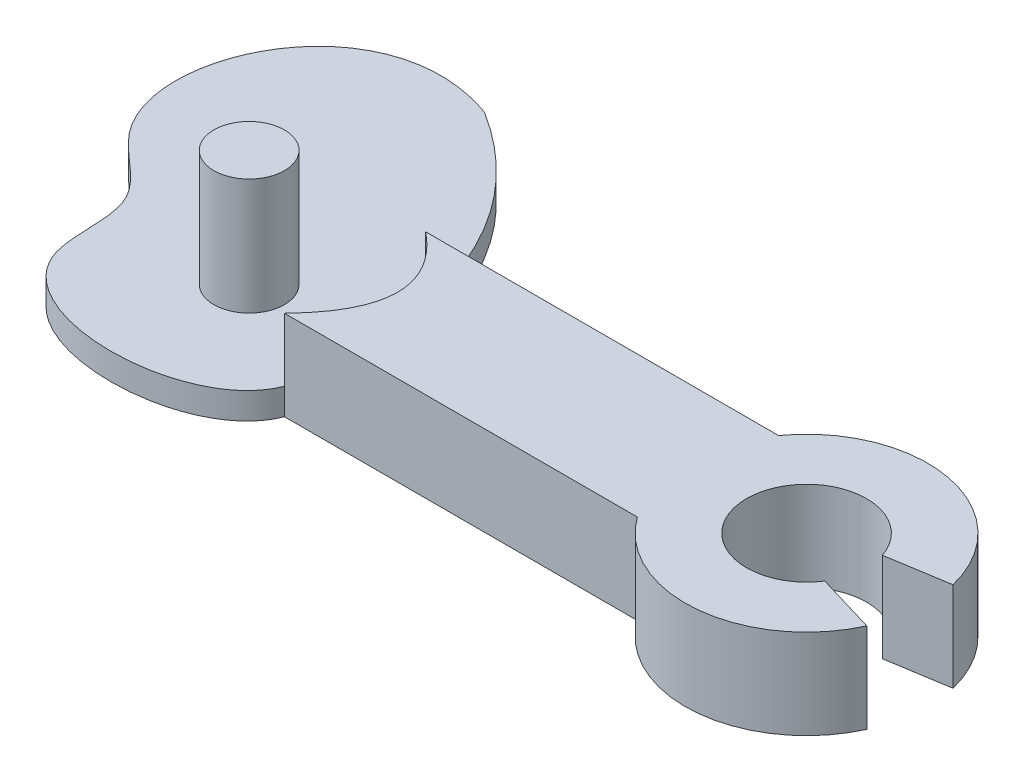
ISO-10303-21;
HEADER;
FILE_DESCRIPTION(('STEP AP214'),'2;1');
FILE_NAME('part.step','',(''),(''),'','','');
FILE_SCHEMA(('AUTOMOTIVE_DESIGN { 1 0 10303 214 1 1 1 1 }'));
ENDSEC;
DATA;
#1=APPLICATION_CONTEXT('core data for automotive mechanical design processes');
#2=APPLICATION_PROTOCOL_DEFINITION('international standard','automotive_design',2000,#1);
#3=PRODUCT_CONTEXT('',#1,'mechanical');
#4=PRODUCT('Part','Part','',(#3));
#5=PRODUCT_RELATED_PRODUCT_CATEGORY('part','',(#4));
#6=PRODUCT_DEFINITION_FORMATION('','',#4);
#7=PRODUCT_DEFINITION_CONTEXT('part definition',#1,'design');
#8=PRODUCT_DEFINITION('design','',#6,#7);
#9=PRODUCT_DEFINITION_SHAPE('','',#8);
#10=(LENGTH_UNIT() NAMED_UNIT(*) SI_UNIT(.MILLI.,.METRE.));
#11=(NAMED_UNIT(*) PLANE_ANGLE_UNIT() SI_UNIT($,.RADIAN.));
#12=(NAMED_UNIT(*) SI_UNIT($,.STERADIAN.) SOLID_ANGLE_UNIT());
#13=UNCERTAINTY_MEASURE_WITH_UNIT(LENGTH_MEASURE(1.E-05),#10,'distance_accuracy_value','');
#14=(GEOMETRIC_REPRESENTATION_CONTEXT(3) GLOBAL_UNCERTAINTY_ASSIGNED_CONTEXT((#13)) GLOBAL_UNIT_ASSIGNED_CONTEXT((#10,
#11,#12)) REPRESENTATION_CONTEXT('',''));
#15=CARTESIAN_POINT('',(0.,0.,0.));
#16=DIRECTION('',(0.,0.,1.));
#17=DIRECTION('',(1.,0.,0.));
#18=AXIS2_PLACEMENT_3D('',#15,#16,#17);
#19=CARTESIAN_POINT('',(-3.89207128643076,2.54,-7.55845384981425));
#20=CARTESIAN_POINT('',(-0.771451313437752,2.54,-5.60167972688043));
#21=CARTESIAN_POINT('',(0.,2.54,-2.));
#22=B_SPLINE_CURVE_WITH_KNOTS('',2,(#19,#20,#21),.UNSPECIFIED.,.F.,.F.,(3,3),(0.,1.),.UNSPECIFIED.);
#23=DIRECTION('',(0.,-1.,0.));
#24=VECTOR('',#23,1.);
#25=SURFACE_OF_LINEAR_EXTRUSION('',#22,#24);
#26=DIRECTION('',(0.,-1.,0.));
#27=VECTOR('',#26,1.);
#28=CARTESIAN_POINT('',(-3.89207128643076,2.54,-7.55845384981425));
#29=LINE('',#28,#27);
#30=CARTESIAN_POINT('',(-3.89207128643076,0.75,-7.55845384981425));
#31=VERTEX_POINT('',#30);
#32=CARTESIAN_POINT('',(-3.89207128643076,0.,-7.55845384981425));
#33=VERTEX_POINT('',#32);
#34=EDGE_CURVE('E184',#31,#33,#29,.T.);
#35=ORIENTED_EDGE('',*,*,#34,.F.);
#36=CARTESIAN_POINT('',(-3.89207128643076,0.75,-7.55845384981425));
#37=CARTESIAN_POINT('',(-0.771451313437752,0.75,-5.60167972688043));
#38=CARTESIAN_POINT('',(0.,0.75,-2.));
#39=B_SPLINE_CURVE_WITH_KNOTS('',2,(#36,#37,#38),.UNSPECIFIED.,.F.,.F.,(3,3),(0.,1.),.UNSPECIFIED.);
#40=CARTESIAN_POINT('',(0.,0.75,-2.));
#41=VERTEX_POINT('',#40);
#42=EDGE_CURVE('E248',#31,#41,#39,.T.);
#43=ORIENTED_EDGE('',*,*,#42,.T.);
#44=DIRECTION('',(0.,-1.,0.));
#45=VECTOR('',#44,1.);
#46=CARTESIAN_POINT('',(0.,2.54,-2.));
#47=LINE('',#46,#45);
#48=CARTESIAN_POINT('',(0.,0.,-2.));
#49=VERTEX_POINT('',#48);
#50=EDGE_CURVE('E186',#41,#49,#47,.T.);
#51=ORIENTED_EDGE('',*,*,#50,.T.);
#52=CARTESIAN_POINT('',(-3.89207128643076,0.,-7.55845384981425));
#53=CARTESIAN_POINT('',(-0.771451313437752,0.,-5.60167972688043));
#54=CARTESIAN_POINT('',(0.,0.,-2.));
#55=B_SPLINE_CURVE_WITH_KNOTS('',2,(#52,#53,#54),.UNSPECIFIED.,.F.,.F.,(3,3),(0.,1.),.UNSPECIFIED.);
#56=EDGE_CURVE('E161',#33,#49,#55,.T.);
#57=ORIENTED_EDGE('',*,*,#56,.F.);
#58=EDGE_LOOP('',(#35,#43,#51,#57));
#59=FACE_BOUND('',#58,.T.);
#60=ADVANCED_FACE('F40',(#59),#25,.T.);
#61=CARTESIAN_POINT('',(0.,2.54,2.));
#62=CARTESIAN_POINT('',(-0.807019420727667,2.54,4.09860570024204));
#63=CARTESIAN_POINT('',(-7.36080053652823,2.54,4.19627669887293));
#64=CARTESIAN_POINT('',(-6.34345772525978,2.54,-0.548340216859602));
#65=CARTESIAN_POINT('',(-10.7782323983558,2.54,-2.92902577270383));
#66=CARTESIAN_POINT('',(-8.05166562519426,2.54,-9.04548340443192));
#67=CARTESIAN_POINT('',(-3.89207128643076,2.54,-7.55845384981425));
#68=B_SPLINE_CURVE_WITH_KNOTS('',3,(#61,#62,#63,#64,#65,#66,#67),.UNSPECIFIED.,.F.,.F.,(4,1,1,1,
4),(0.,0.355860312878933,0.470047608142096,0.583542680614252,1.),.UNSPECIFIED.);
#69=DIRECTION('',(0.,-1.,0.));
#70=VECTOR('',#69,1.);
#71=SURFACE_OF_LINEAR_EXTRUSION('',#68,#70);
#72=DIRECTION('',(0.,-1.,0.));
#73=VECTOR('',#72,1.);
#74=CARTESIAN_POINT('',(0.,2.54,2.));
#75=LINE('',#74,#73);
#76=CARTESIAN_POINT('',(0.,0.75,2.));
#77=VERTEX_POINT('',#76);
#78=CARTESIAN_POINT('',(0.,0.,2.));
#79=VERTEX_POINT('',#78);
#80=EDGE_CURVE('E127',#77,#79,#75,.T.);
#81=ORIENTED_EDGE('',*,*,#80,.F.);
#82=CARTESIAN_POINT('',(0.,0.75,2.));
#83=CARTESIAN_POINT('',(-0.807019420727667,0.75,4.09860570024204));
#84=CARTESIAN_POINT('',(-7.36080053652823,0.75,4.19627669887293));
#85=CARTESIAN_POINT('',(-6.34345772525978,0.75,-0.548340216859602));
#86=CARTESIAN_POINT('',(-10.7782323983558,0.75,-2.92902577270383));
#87=CARTESIAN_POINT('',(-8.05166562519426,0.75,-9.04548340443192));
#88=CARTESIAN_POINT('',(-3.89207128643076,0.75,-7.55845384981425));
#89=B_SPLINE_CURVE_WITH_KNOTS('',3,(#82,#83,#84,#85,#86,#87,#88),.UNSPECIFIED.,.F.,.F.,(4,1,1,1,
4),(0.,0.355860312878933,0.470047608142096,0.583542680614252,1.),.UNSPECIFIED.);
#90=EDGE_CURVE('E253',#77,#31,#89,.T.);
#91=ORIENTED_EDGE('',*,*,#90,.T.);
#92=ORIENTED_EDGE('',*,*,#34,.T.);
#93=CARTESIAN_POINT('',(0.,0.,2.));
#94=CARTESIAN_POINT('',(-0.807019420727667,0.,4.09860570024204));
#95=CARTESIAN_POINT('',(-7.36080053652823,0.,4.19627669887293));
#96=CARTESIAN_POINT('',(-6.34345772525978,0.,-0.548340216859602));
#97=CARTESIAN_POINT('',(-10.7782323983558,0.,-2.92902577270383));
#98=CARTESIAN_POINT('',(-8.05166562519426,0.,-9.04548340443192));
#99=CARTESIAN_POINT('',(-3.89207128643076,0.,-7.55845384981425));
#100=B_SPLINE_CURVE_WITH_KNOTS('',3,(#93,#94,#95,#96,#97,#98,#99),.UNSPECIFIED.,.F.,.F.,(4,1,1,
1,4),(0.,0.355860312878933,0.470047608142096,0.583542680614252,1.),.UNSPECIFIED.);
#101=EDGE_CURVE('E166',#79,#33,#100,.T.);
#102=ORIENTED_EDGE('',*,*,#101,.F.);
#103=EDGE_LOOP('',(#81,#91,#92,#102));
#104=FACE_BOUND('',#103,.T.);
#105=ADVANCED_FACE('F218',(#104),#71,.T.);
#106=CARTESIAN_POINT('',(12.794,2.54,0.));
#107=DIRECTION('',(0.,-1.,0.));
#108=DIRECTION('',(0.,0.,-1.));
#109=AXIS2_PLACEMENT_3D('',#106,#107,#108);
#110=CYLINDRICAL_SURFACE('',#109,1.7);
#111=CARTESIAN_POINT('',(12.794,0.,0.));
#112=DIRECTION('',(0.,1.,0.));
#113=DIRECTION('',(0.,0.,1.));
#114=AXIS2_PLACEMENT_3D('',#111,#112,#113);
#115=CIRCLE('',#114,1.7);
#116=CARTESIAN_POINT('',(14.2261023097936,0.,0.916014723835713));
#117=VERTEX_POINT('',#116);
#118=CARTESIAN_POINT('',(14.408639420947,0.,-0.531920614682185));
#119=VERTEX_POINT('',#118);
#120=EDGE_CURVE('E148',#117,#119,#115,.F.);
#121=ORIENTED_EDGE('',*,*,#120,.T.);
#122=DIRECTION('',(0.,-1.,0.));
#123=VECTOR('',#122,1.);
#124=CARTESIAN_POINT('',(14.408639420947,2.54,-0.531920614682185));
#125=LINE('',#124,#123);
#126=CARTESIAN_POINT('',(14.408639420947,2.54,-0.531920614682185));
#127=VERTEX_POINT('',#126);
#128=EDGE_CURVE('E194',#127,#119,#125,.T.);
#129=ORIENTED_EDGE('',*,*,#128,.F.);
#130=CARTESIAN_POINT('',(12.794,2.54,0.));
#131=DIRECTION('',(0.,1.,0.));
#132=DIRECTION('',(0.,0.,1.));
#133=AXIS2_PLACEMENT_3D('',#130,#131,#132);
#134=CIRCLE('',#133,1.7);
#135=CARTESIAN_POINT('',(14.2261023097936,2.54,0.916014723835713));
#136=VERTEX_POINT('',#135);
#137=EDGE_CURVE('E103',#136,#127,#134,.F.);
#138=ORIENTED_EDGE('',*,*,#137,.F.);
#139=DIRECTION('',(0.,-1.,0.));
#140=VECTOR('',#139,1.);
#141=CARTESIAN_POINT('',(14.2261023097936,2.54,0.916014723835713));
#142=LINE('',#141,#140);
#143=EDGE_CURVE('E147',#136,#117,#142,.T.);
#144=ORIENTED_EDGE('',*,*,#143,.T.);
#145=EDGE_LOOP('',(#121,#129,#138,#144));
#146=FACE_BOUND('',#145,.T.);
#147=ADVANCED_FACE('F42',(#146),#110,.F.);
#148=CARTESIAN_POINT('',(0.281759382160779,2.54,1.74677809510191));
#149=DIRECTION('',(0.159243995436628,0.,0.987239256673568));
#150=DIRECTION('',(0.987239256673568,0.,-0.159243995436628));
#151=AXIS2_PLACEMENT_3D('',#148,#149,#150);
#152=PLANE('',#151);
#153=DIRECTION('',(-0.987239256673568,0.,0.159243995436628));
#154=VECTOR('',#153,1.);
#155=CARTESIAN_POINT('',(0.281759382160779,0.,1.74677809510191));
#156=LINE('',#155,#154);
#157=CARTESIAN_POINT('',(16.1331889635571,0.,-0.810094479464426));
#158=VERTEX_POINT('',#157);
#159=EDGE_CURVE('E151',#158,#119,#156,.T.);
#160=ORIENTED_EDGE('',*,*,#159,.F.);
#161=DIRECTION('',(0.,-1.,0.));
#162=VECTOR('',#161,1.);
#163=CARTESIAN_POINT('',(16.1331889635571,2.54,-0.810094479464426));
#164=LINE('',#163,#162);
#165=CARTESIAN_POINT('',(16.1331889635571,2.54,-0.810094479464426));
#166=VERTEX_POINT('',#165);
#167=EDGE_CURVE('E192',#166,#158,#164,.T.);
#168=ORIENTED_EDGE('',*,*,#167,.F.);
#169=DIRECTION('',(-0.987239256673568,0.,0.159243995436628));
#170=VECTOR('',#169,1.);
#171=CARTESIAN_POINT('',(0.281759382160779,2.54,1.74677809510191));
#172=LINE('',#171,#170);
#173=EDGE_CURVE('E240',#166,#127,#172,.T.);
#174=ORIENTED_EDGE('',*,*,#173,.T.);
#175=ORIENTED_EDGE('',*,*,#128,.T.);
#176=EDGE_LOOP('',(#160,#168,#174,#175));
#177=FACE_BOUND('',#176,.T.);
#178=ADVANCED_FACE('F323',(#177),#152,.T.);
#179=CARTESIAN_POINT('',(12.794,2.54,0.));
#180=DIRECTION('',(0.,-1.,0.));
#181=DIRECTION('',(0.,0.,-1.));
#182=AXIS2_PLACEMENT_3D('',#179,#180,#181);
#183=CYLINDRICAL_SURFACE('',#182,3.43604947577883);
#184=CARTESIAN_POINT('',(12.794,0.,0.));
#185=DIRECTION('',(0.,1.,0.));
#186=DIRECTION('',(0.,0.,1.));
#187=AXIS2_PLACEMENT_3D('',#184,#185,#186);
#188=CIRCLE('',#187,3.43604947577883);
#189=CARTESIAN_POINT('',(10.,0.,-2.));
#190=VERTEX_POINT('',#189);
#191=EDGE_CURVE('E155',#190,#158,#188,.F.);
#192=ORIENTED_EDGE('',*,*,#191,.F.);
#193=DIRECTION('',(0.,-1.,0.));
#194=VECTOR('',#193,1.);
#195=CARTESIAN_POINT('',(10.,2.54,-2.));
#196=LINE('',#195,#194);
#197=CARTESIAN_POINT('',(10.,2.54,-2.));
#198=VERTEX_POINT('',#197);
#199=EDGE_CURVE('E190',#198,#190,#196,.T.);
#200=ORIENTED_EDGE('',*,*,#199,.F.);
#201=CARTESIAN_POINT('',(12.794,2.54,0.));
#202=DIRECTION('',(0.,1.,0.));
#203=DIRECTION('',(0.,0.,1.));
#204=AXIS2_PLACEMENT_3D('',#201,#202,#203);
#205=CIRCLE('',#204,3.43604947577883);
#206=EDGE_CURVE('E138',#198,#166,#205,.F.);
#207=ORIENTED_EDGE('',*,*,#206,.T.);
#208=ORIENTED_EDGE('',*,*,#167,.T.);
#209=EDGE_LOOP('',(#192,#200,#207,#208));
#210=FACE_BOUND('',#209,.T.);
#211=ADVANCED_FACE('F321',(#210),#183,.T.);
#212=CARTESIAN_POINT('',(0.,2.54,-2.));
#213=DIRECTION('',(0.,0.,1.));
#214=DIRECTION('',(1.,0.,0.));
#215=AXIS2_PLACEMENT_3D('',#212,#213,#214);
#216=PLANE('',#215);
#217=DIRECTION('',(-1.,0.,0.));
#218=VECTOR('',#217,1.);
#219=CARTESIAN_POINT('',(0.,0.,-2.));
#220=LINE('',#219,#218);
#221=EDGE_CURVE('E158',#190,#49,#220,.T.);
#222=ORIENTED_EDGE('',*,*,#221,.T.);
#223=ORIENTED_EDGE('',*,*,#50,.F.);
#224=CARTESIAN_POINT('',(0.,2.54,-2.));
#225=VERTEX_POINT('',#224);
#226=EDGE_CURVE('E187',#225,#41,#47,.T.);
#227=ORIENTED_EDGE('',*,*,#226,.F.);
#228=DIRECTION('',(-1.,0.,0.));
#229=VECTOR('',#228,1.);
#230=CARTESIAN_POINT('',(0.,2.54,-2.));
#231=LINE('',#230,#229);
#232=EDGE_CURVE('E136',#198,#225,#231,.T.);
#233=ORIENTED_EDGE('',*,*,#232,.F.);
#234=ORIENTED_EDGE('',*,*,#199,.T.);
#235=EDGE_LOOP('',(#222,#223,#227,#233,#234));
#236=FACE_BOUND('',#235,.T.);
#237=ADVANCED_FACE('F229',(#236),#216,.F.);
#238=CARTESIAN_POINT('',(0.,2.54,2.));
#239=DIRECTION('',(0.,0.,1.));
#240=DIRECTION('',(1.,0.,0.));
#241=AXIS2_PLACEMENT_3D('',#238,#239,#240);
#242=PLANE('',#241);
#243=DIRECTION('',(-1.,0.,0.));
#244=VECTOR('',#243,1.);
#245=CARTESIAN_POINT('',(0.,0.,2.));
#246=LINE('',#245,#244);
#247=CARTESIAN_POINT('',(10.,0.,2.));
#248=VERTEX_POINT('',#247);
#249=EDGE_CURVE('E126',#248,#79,#246,.T.);
#250=ORIENTED_EDGE('',*,*,#249,.F.);
#251=DIRECTION('',(0.,-1.,0.));
#252=VECTOR('',#251,1.);
#253=CARTESIAN_POINT('',(10.,2.54,2.));
#254=LINE('',#253,#252);
#255=CARTESIAN_POINT('',(10.,2.54,2.));
#256=VERTEX_POINT('',#255);
#257=EDGE_CURVE('E119',#256,#248,#254,.T.);
#258=ORIENTED_EDGE('',*,*,#257,.F.);
#259=DIRECTION('',(-1.,0.,0.));
#260=VECTOR('',#259,1.);
#261=CARTESIAN_POINT('',(0.,2.54,2.));
#262=LINE('',#261,#260);
#263=CARTESIAN_POINT('',(0.,2.54,2.));
#264=VERTEX_POINT('',#263);
#265=EDGE_CURVE('E124',#256,#264,#262,.T.);
#266=ORIENTED_EDGE('',*,*,#265,.T.);
#267=EDGE_CURVE('E182',#264,#77,#75,.T.);
#268=ORIENTED_EDGE('',*,*,#267,.T.);
#269=ORIENTED_EDGE('',*,*,#80,.T.);
#270=EDGE_LOOP('',(#250,#258,#266,#268,#269));
#271=FACE_BOUND('',#270,.T.);
#272=ADVANCED_FACE('F121',(#271),#242,.T.);
#273=CARTESIAN_POINT('',(12.794,2.54,0.));
#274=DIRECTION('',(0.,-1.,0.));
#275=DIRECTION('',(0.,0.,-1.));
#276=AXIS2_PLACEMENT_3D('',#273,#274,#275);
#277=CYLINDRICAL_SURFACE('',#276,3.43604947577883);
#278=CARTESIAN_POINT('',(12.794,0.,0.));
#279=DIRECTION('',(0.,1.,0.));
#280=DIRECTION('',(0.,0.,1.));
#281=AXIS2_PLACEMENT_3D('',#278,#279,#280);
#282=CIRCLE('',#281,3.43604947577883);
#283=CARTESIAN_POINT('',(15.9223503044234,0.,1.42121791883381));
#284=VERTEX_POINT('',#283);
#285=EDGE_CURVE('E91',#248,#284,#282,.T.);
#286=ORIENTED_EDGE('',*,*,#285,.T.);
#287=DIRECTION('',(0.,-1.,0.));
#288=VECTOR('',#287,1.);
#289=CARTESIAN_POINT('',(15.9223503044234,2.54,1.42121791883381));
#290=LINE('',#289,#288);
#291=CARTESIAN_POINT('',(15.9223503044234,2.54,1.42121791883381));
#292=VERTEX_POINT('',#291);
#293=EDGE_CURVE('E128',#292,#284,#290,.T.);
#294=ORIENTED_EDGE('',*,*,#293,.F.);
#295=CARTESIAN_POINT('',(12.794,2.54,0.));
#296=DIRECTION('',(0.,1.,0.));
#297=DIRECTION('',(0.,0.,1.));
#298=AXIS2_PLACEMENT_3D('',#295,#296,#297);
#299=CIRCLE('',#298,3.43604947577883);
#300=EDGE_CURVE('E130',#256,#292,#299,.T.);
#301=ORIENTED_EDGE('',*,*,#300,.F.);
#302=ORIENTED_EDGE('',*,*,#257,.T.);
#303=EDGE_LOOP('',(#286,#294,#301,#302));
#304=FACE_BOUND('',#303,.T.);
#305=ADVANCED_FACE('F131',(#304),#277,.T.);
#306=CARTESIAN_POINT('',(0.908528175015129,2.54,-3.05043418211133));
#307=DIRECTION('',(-0.285444325081709,0.,0.958395292809104));
#308=DIRECTION('',(0.958395292809104,0.,0.285444325081709));
#309=AXIS2_PLACEMENT_3D('',#306,#307,#308);
#310=PLANE('',#309);
#311=DIRECTION('',(-0.958395292809104,0.,-0.285444325081709));
#312=VECTOR('',#311,1.);
#313=CARTESIAN_POINT('',(0.908528175015129,0.,-3.05043418211133));
#314=LINE('',#313,#312);
#315=EDGE_CURVE('E97',#284,#117,#314,.T.);
#316=ORIENTED_EDGE('',*,*,#315,.T.);
#317=ORIENTED_EDGE('',*,*,#143,.F.);
#318=DIRECTION('',(-0.958395292809104,0.,-0.285444325081709));
#319=VECTOR('',#318,1.);
#320=CARTESIAN_POINT('',(0.908528175015129,2.54,-3.05043418211133));
#321=LINE('',#320,#319);
#322=EDGE_CURVE('E59',#292,#136,#321,.T.);
#323=ORIENTED_EDGE('',*,*,#322,.F.);
#324=ORIENTED_EDGE('',*,*,#293,.T.);
#325=EDGE_LOOP('',(#316,#317,#323,#324));
#326=FACE_BOUND('',#325,.T.);
#327=ADVANCED_FACE('F208',(#326),#310,.F.);
#328=CARTESIAN_POINT('',(0.,2.54,0.));
#329=DIRECTION('',(0.,1.,0.));
#330=DIRECTION('',(0.,0.,1.));
#331=AXIS2_PLACEMENT_3D('',#328,#329,#330);
#332=PLANE('',#331);
#333=CARTESIAN_POINT('',(0.,2.54,2.));
#334=CARTESIAN_POINT('',(2.17515280569474,2.54,-0.238184258237295));
#335=CARTESIAN_POINT('',(0.,2.54,-2.));
#336=B_SPLINE_CURVE_WITH_KNOTS('',2,(#333,#334,#335),.UNSPECIFIED.,.F.,.F.,(3,3),(0.,1.),.UNSPECIFIED.);
#337=EDGE_CURVE('E11',#264,#225,#336,.T.);
#338=ORIENTED_EDGE('',*,*,#337,.F.);
#339=ORIENTED_EDGE('',*,*,#265,.F.);
#340=ORIENTED_EDGE('',*,*,#300,.T.);
#341=ORIENTED_EDGE('',*,*,#322,.T.);
#342=ORIENTED_EDGE('',*,*,#137,.T.);
#343=ORIENTED_EDGE('',*,*,#173,.F.);
#344=ORIENTED_EDGE('',*,*,#206,.F.);
#345=ORIENTED_EDGE('',*,*,#232,.T.);
#346=EDGE_LOOP('',(#338,#339,#340,#341,#342,#343,#344,#345));
#347=FACE_BOUND('',#346,.T.);
#348=ADVANCED_FACE('F134',(#347),#332,.T.);
#349=CARTESIAN_POINT('',(0.,0.,0.));
#350=DIRECTION('',(0.,1.,0.));
#351=DIRECTION('',(0.,0.,1.));
#352=AXIS2_PLACEMENT_3D('',#349,#350,#351);
#353=PLANE('',#352);
#354=CARTESIAN_POINT('',(-4.87243724358624,0.,-3.50133621740525));
#355=DIRECTION('',(0.,1.,0.));
#356=DIRECTION('',(0.,0.,1.));
#357=AXIS2_PLACEMENT_3D('',#354,#355,#356);
#358=CIRCLE('',#357,1.);
#359=CARTESIAN_POINT('',(-4.87243724358624,0.,-2.50133621740525));
#360=VERTEX_POINT('',#359);
#361=EDGE_CURVE('E51',#360,#360,#358,.F.);
#362=ORIENTED_EDGE('',*,*,#361,.F.);
#363=EDGE_LOOP('',(#362));
#364=FACE_BOUND('',#363,.T.);
#365=ORIENTED_EDGE('',*,*,#120,.F.);
#366=ORIENTED_EDGE('',*,*,#315,.F.);
#367=ORIENTED_EDGE('',*,*,#285,.F.);
#368=ORIENTED_EDGE('',*,*,#249,.T.);
#369=ORIENTED_EDGE('',*,*,#101,.T.);
#370=ORIENTED_EDGE('',*,*,#56,.T.);
#371=ORIENTED_EDGE('',*,*,#221,.F.);
#372=ORIENTED_EDGE('',*,*,#191,.T.);
#373=ORIENTED_EDGE('',*,*,#159,.T.);
#374=EDGE_LOOP('',(#365,#366,#367,#368,#369,#370,#371,#372,#373));
#375=FACE_BOUND('',#374,.T.);
#376=ADVANCED_FACE('F200',(#364,#375),#353,.F.);
#377=CARTESIAN_POINT('',(-4.87243724358624,-1.5,-3.50133621740525));
#378=DIRECTION('',(0.,1.,0.));
#379=DIRECTION('',(0.,0.,1.));
#380=AXIS2_PLACEMENT_3D('',#377,#378,#379);
#381=CYLINDRICAL_SURFACE('',#380,1.);
#382=CARTESIAN_POINT('',(-4.87243724358624,-1.5,-3.50133621740525));
#383=DIRECTION('',(0.,-1.,0.));
#384=DIRECTION('',(0.,0.,-1.));
#385=AXIS2_PLACEMENT_3D('',#382,#383,#384);
#386=CIRCLE('',#385,1.);
#387=CARTESIAN_POINT('',(-4.87243724358624,-1.5,-4.50133621740525));
#388=VERTEX_POINT('',#387);
#389=EDGE_CURVE('E245',#388,#388,#386,.T.);
#390=ORIENTED_EDGE('',*,*,#389,.F.);
#391=EDGE_LOOP('',(#390));
#392=FACE_BOUND('',#391,.T.);
#393=ORIENTED_EDGE('',*,*,#361,.T.);
#394=EDGE_LOOP('',(#393));
#395=FACE_BOUND('',#394,.T.);
#396=ADVANCED_FACE('F198',(#392,#395),#381,.T.);
#397=CARTESIAN_POINT('',(-4.87243724358624,-1.5,-3.50133621740525));
#398=DIRECTION('',(0.,-1.,0.));
#399=DIRECTION('',(0.,0.,-1.));
#400=AXIS2_PLACEMENT_3D('',#397,#398,#399);
#401=PLANE('',#400);
#402=ORIENTED_EDGE('',*,*,#389,.T.);
#403=EDGE_LOOP('',(#402));
#404=FACE_BOUND('',#403,.T.);
#405=ADVANCED_FACE('F280',(#404),#401,.T.);
#406=CARTESIAN_POINT('',(0.,0.75,2.));
#407=CARTESIAN_POINT('',(2.17515280569474,0.75,-0.238184258237295));
#408=CARTESIAN_POINT('',(0.,0.75,-2.));
#409=B_SPLINE_CURVE_WITH_KNOTS('',2,(#406,#407,#408),.UNSPECIFIED.,.F.,.F.,(3,3),(0.,1.),.UNSPECIFIED.);
#410=DIRECTION('',(0.,1.,0.));
#411=VECTOR('',#410,1.);
#412=SURFACE_OF_LINEAR_EXTRUSION('',#409,#411);
#413=ORIENTED_EDGE('',*,*,#337,.T.);
#414=ORIENTED_EDGE('',*,*,#226,.T.);
#415=EDGE_CURVE('E261',#77,#41,#409,.T.);
#416=ORIENTED_EDGE('',*,*,#415,.F.);
#417=ORIENTED_EDGE('',*,*,#267,.F.);
#418=EDGE_LOOP('',(#413,#414,#416,#417));
#419=FACE_BOUND('',#418,.T.);
#420=ADVANCED_FACE('F275',(#419),#412,.F.);
#421=CARTESIAN_POINT('',(1.08757640284737,0.75,-0.119092129118647));
#422=DIRECTION('',(0.,1.,0.));
#423=DIRECTION('',(0.,0.,1.));
#424=AXIS2_PLACEMENT_3D('',#421,#422,#423);
#425=PLANE('',#424);
#426=CARTESIAN_POINT('',(-3.,0.75,0.));
#427=DIRECTION('',(0.,1.,0.));
#428=DIRECTION('',(0.,0.,1.));
#429=AXIS2_PLACEMENT_3D('',#426,#427,#428);
#430=CIRCLE('',#429,1.);
#431=CARTESIAN_POINT('',(-3.,0.75,1.));
#432=VERTEX_POINT('',#431);
#433=EDGE_CURVE('E270',#432,#432,#430,.T.);
#434=ORIENTED_EDGE('',*,*,#433,.F.);
#435=EDGE_LOOP('',(#434));
#436=FACE_BOUND('',#435,.T.);
#437=ORIENTED_EDGE('',*,*,#90,.F.);
#438=ORIENTED_EDGE('',*,*,#415,.T.);
#439=ORIENTED_EDGE('',*,*,#42,.F.);
#440=EDGE_LOOP('',(#437,#438,#439));
#441=FACE_BOUND('',#440,.T.);
#442=ADVANCED_FACE('F279',(#436,#441),#425,.T.);
#443=CARTESIAN_POINT('',(0.,4.04,0.));
#444=DIRECTION('',(0.,1.,0.));
#445=DIRECTION('',(0.,0.,1.));
#446=AXIS2_PLACEMENT_3D('',#443,#444,#445);
#447=PLANE('',#446);
#448=CARTESIAN_POINT('',(-3.,4.04,0.));
#449=DIRECTION('',(0.,1.,0.));
#450=DIRECTION('',(0.,0.,1.));
#451=AXIS2_PLACEMENT_3D('',#448,#449,#450);
#452=CIRCLE('',#451,1.);
#453=CARTESIAN_POINT('',(-3.,4.04,1.));
#454=VERTEX_POINT('',#453);
#455=EDGE_CURVE('E152',#454,#454,#452,.T.);
#456=ORIENTED_EDGE('',*,*,#455,.T.);
#457=EDGE_LOOP('',(#456));
#458=FACE_BOUND('',#457,.T.);
#459=ADVANCED_FACE('F288',(#458),#447,.T.);
#460=CARTESIAN_POINT('',(-3.,4.04,0.));
#461=DIRECTION('',(0.,-1.,0.));
#462=DIRECTION('',(0.,0.,-1.));
#463=AXIS2_PLACEMENT_3D('',#460,#461,#462);
#464=CYLINDRICAL_SURFACE('',#463,1.);
#465=ORIENTED_EDGE('',*,*,#455,.F.);
#466=EDGE_LOOP('',(#465));
#467=FACE_BOUND('',#466,.T.);
#468=ORIENTED_EDGE('',*,*,#433,.T.);
#469=EDGE_LOOP('',(#468));
#470=FACE_BOUND('',#469,.T.);
#471=ADVANCED_FACE('F291',(#467,#470),#464,.T.);
#472=CLOSED_SHELL('',(#60,#105,#147,#178,#211,#237,#272,#305,#327,#348,#376,#396,#405,#420,#442,
#459,#471));
#473=MANIFOLD_SOLID_BREP('B2',#472);
#474=ADVANCED_BREP_SHAPE_REPRESENTATION('',(#18,#473),#14);
#475=SHAPE_DEFINITION_REPRESENTATION(#9,#474);
ENDSEC;
END-ISO-10303-21;
